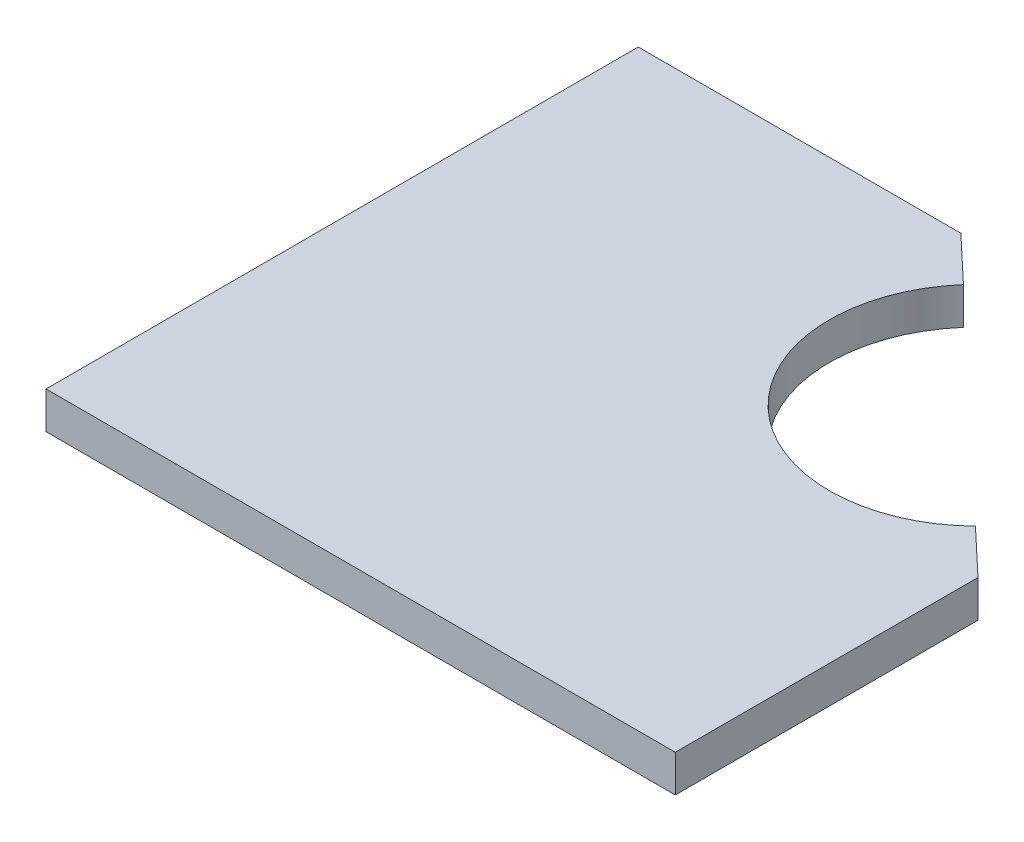
ISO-10303-21;
HEADER;
FILE_DESCRIPTION(('STEP AP214'),'2;1');
FILE_NAME('part.step','',(''),(''),'','','');
FILE_SCHEMA(('AUTOMOTIVE_DESIGN { 1 0 10303 214 1 1 1 1 }'));
ENDSEC;
DATA;
#1=APPLICATION_CONTEXT('core data for automotive mechanical design processes');
#2=APPLICATION_PROTOCOL_DEFINITION('international standard','automotive_design',2000,#1);
#3=PRODUCT_CONTEXT('',#1,'mechanical');
#4=PRODUCT('Part','Part','',(#3));
#5=PRODUCT_RELATED_PRODUCT_CATEGORY('part','',(#4));
#6=PRODUCT_DEFINITION_FORMATION('','',#4);
#7=PRODUCT_DEFINITION_CONTEXT('part definition',#1,'design');
#8=PRODUCT_DEFINITION('design','',#6,#7);
#9=PRODUCT_DEFINITION_SHAPE('','',#8);
#10=(LENGTH_UNIT() NAMED_UNIT(*) SI_UNIT(.MILLI.,.METRE.));
#11=(NAMED_UNIT(*) PLANE_ANGLE_UNIT() SI_UNIT($,.RADIAN.));
#12=(NAMED_UNIT(*) SI_UNIT($,.STERADIAN.) SOLID_ANGLE_UNIT());
#13=UNCERTAINTY_MEASURE_WITH_UNIT(LENGTH_MEASURE(1.E-05),#10,'distance_accuracy_value','');
#14=(GEOMETRIC_REPRESENTATION_CONTEXT(3) GLOBAL_UNCERTAINTY_ASSIGNED_CONTEXT((#13)) GLOBAL_UNIT_ASSIGNED_CONTEXT((#10,
#11,#12)) REPRESENTATION_CONTEXT('',''));
#15=CARTESIAN_POINT('',(0.,0.,0.));
#16=DIRECTION('',(0.,0.,1.));
#17=DIRECTION('',(1.,0.,0.));
#18=AXIS2_PLACEMENT_3D('',#15,#16,#17);
#19=CARTESIAN_POINT('',(22.3125,5.,-21.));
#20=DIRECTION('',(0.,-1.,0.));
#21=DIRECTION('',(0.,0.,-1.));
#22=AXIS2_PLACEMENT_3D('',#19,#20,#21);
#23=CYLINDRICAL_SURFACE('',#22,20.);
#24=CARTESIAN_POINT('',(22.3125,0.,-21.));
#25=DIRECTION('',(0.,1.,0.));
#26=DIRECTION('',(0.,0.,1.));
#27=AXIS2_PLACEMENT_3D('',#24,#25,#26);
#28=CIRCLE('',#27,20.);
#29=CARTESIAN_POINT('',(7.25617496759492,0.,-34.1646145601978));
#30=VERTEX_POINT('',#29);
#31=CARTESIAN_POINT('',(36.3195245515459,0.,-6.72403196934119));
#32=VERTEX_POINT('',#31);
#33=EDGE_CURVE('E122',#30,#32,#28,.T.);
#34=ORIENTED_EDGE('',*,*,#33,.F.);
#35=DIRECTION('',(0.,-1.,0.));
#36=VECTOR('',#35,1.);
#37=CARTESIAN_POINT('',(7.25617496759492,5.,-34.1646145601978));
#38=LINE('',#37,#36);
#39=CARTESIAN_POINT('',(7.25617496759492,5.,-34.1646145601978));
#40=VERTEX_POINT('',#39);
#41=EDGE_CURVE('E11',#40,#30,#38,.T.);
#42=ORIENTED_EDGE('',*,*,#41,.F.);
#43=CARTESIAN_POINT('',(22.3125,5.,-21.));
#44=DIRECTION('',(0.,1.,0.));
#45=DIRECTION('',(0.,0.,1.));
#46=AXIS2_PLACEMENT_3D('',#43,#44,#45);
#47=CIRCLE('',#46,20.);
#48=CARTESIAN_POINT('',(36.3195245515459,5.,-6.72403196934119));
#49=VERTEX_POINT('',#48);
#50=EDGE_CURVE('E139',#40,#49,#47,.T.);
#51=ORIENTED_EDGE('',*,*,#50,.T.);
#52=DIRECTION('',(0.,-1.,0.));
#53=VECTOR('',#52,1.);
#54=CARTESIAN_POINT('',(36.3195245515459,5.,-6.72403196934119));
#55=LINE('',#54,#53);
#56=EDGE_CURVE('E51',#49,#32,#55,.T.);
#57=ORIENTED_EDGE('',*,*,#56,.T.);
#58=EDGE_LOOP('',(#34,#42,#51,#57));
#59=FACE_BOUND('',#58,.T.);
#60=ADVANCED_FACE('F35',(#59),#23,.F.);
#61=CARTESIAN_POINT('',(20.4740163325139,5.,-21.6847981302571));
#62=DIRECTION('',(0.686515934094375,0.,-0.727114758641665));
#63=DIRECTION('',(-0.727114758641665,0.,-0.686515934094375));
#64=AXIS2_PLACEMENT_3D('',#61,#62,#63);
#65=PLANE('',#64);
#66=DIRECTION('',(0.727114758641665,0.,0.686515934094375));
#67=VECTOR('',#66,1.);
#68=CARTESIAN_POINT('',(20.4740163325139,0.,-21.6847981302571));
#69=LINE('',#68,#67);
#70=CARTESIAN_POINT('',(1.07569951914076,0.,-40.));
#71=VERTEX_POINT('',#70);
#72=EDGE_CURVE('E124',#71,#30,#69,.T.);
#73=ORIENTED_EDGE('',*,*,#72,.F.);
#74=DIRECTION('',(0.,-1.,0.));
#75=VECTOR('',#74,1.);
#76=CARTESIAN_POINT('',(1.07569951914076,5.,-40.));
#77=LINE('',#76,#75);
#78=CARTESIAN_POINT('',(1.07569951914076,5.,-40.));
#79=VERTEX_POINT('',#78);
#80=EDGE_CURVE('E43',#79,#71,#77,.T.);
#81=ORIENTED_EDGE('',*,*,#80,.F.);
#82=DIRECTION('',(0.727114758641665,0.,0.686515934094375));
#83=VECTOR('',#82,1.);
#84=CARTESIAN_POINT('',(20.4740163325139,5.,-21.6847981302571));
#85=LINE('',#84,#83);
#86=EDGE_CURVE('E159',#79,#40,#85,.T.);
#87=ORIENTED_EDGE('',*,*,#86,.T.);
#88=ORIENTED_EDGE('',*,*,#41,.T.);
#89=EDGE_LOOP('',(#73,#81,#87,#88));
#90=FACE_BOUND('',#89,.T.);
#91=ADVANCED_FACE('F153',(#90),#65,.T.);
#92=CARTESIAN_POINT('',(0.,5.,-40.));
#93=DIRECTION('',(0.,0.,-1.));
#94=DIRECTION('',(-1.,0.,0.));
#95=AXIS2_PLACEMENT_3D('',#92,#93,#94);
#96=PLANE('',#95);
#97=DIRECTION('',(1.,0.,0.));
#98=VECTOR('',#97,1.);
#99=CARTESIAN_POINT('',(0.,0.,-40.));
#100=LINE('',#99,#98);
#101=CARTESIAN_POINT('',(-42.5,0.,-40.));
#102=VERTEX_POINT('',#101);
#103=EDGE_CURVE('E127',#102,#71,#100,.T.);
#104=ORIENTED_EDGE('',*,*,#103,.F.);
#105=DIRECTION('',(0.,-1.,0.));
#106=VECTOR('',#105,1.);
#107=CARTESIAN_POINT('',(-42.5,5.,-40.));
#108=LINE('',#107,#106);
#109=CARTESIAN_POINT('',(-42.5,5.,-40.));
#110=VERTEX_POINT('',#109);
#111=EDGE_CURVE('E143',#110,#102,#108,.T.);
#112=ORIENTED_EDGE('',*,*,#111,.F.);
#113=DIRECTION('',(1.,0.,0.));
#114=VECTOR('',#113,1.);
#115=CARTESIAN_POINT('',(0.,5.,-40.));
#116=LINE('',#115,#114);
#117=EDGE_CURVE('E149',#110,#79,#116,.T.);
#118=ORIENTED_EDGE('',*,*,#117,.T.);
#119=ORIENTED_EDGE('',*,*,#80,.T.);
#120=EDGE_LOOP('',(#104,#112,#118,#119));
#121=FACE_BOUND('',#120,.T.);
#122=ADVANCED_FACE('F148',(#121),#96,.T.);
#123=CARTESIAN_POINT('',(-42.5,5.,0.));
#124=DIRECTION('',(-1.,0.,0.));
#125=DIRECTION('',(0.,0.,1.));
#126=AXIS2_PLACEMENT_3D('',#123,#124,#125);
#127=PLANE('',#126);
#128=DIRECTION('',(0.,0.,-1.));
#129=VECTOR('',#128,1.);
#130=CARTESIAN_POINT('',(-42.5,0.,0.));
#131=LINE('',#130,#129);
#132=CARTESIAN_POINT('',(-42.5,0.,40.));
#133=VERTEX_POINT('',#132);
#134=EDGE_CURVE('E130',#133,#102,#131,.T.);
#135=ORIENTED_EDGE('',*,*,#134,.F.);
#136=DIRECTION('',(0.,-1.,0.));
#137=VECTOR('',#136,1.);
#138=CARTESIAN_POINT('',(-42.5,5.,40.));
#139=LINE('',#138,#137);
#140=CARTESIAN_POINT('',(-42.5,5.,40.));
#141=VERTEX_POINT('',#140);
#142=EDGE_CURVE('E104',#141,#133,#139,.T.);
#143=ORIENTED_EDGE('',*,*,#142,.F.);
#144=DIRECTION('',(0.,0.,-1.));
#145=VECTOR('',#144,1.);
#146=CARTESIAN_POINT('',(-42.5,5.,0.));
#147=LINE('',#146,#145);
#148=EDGE_CURVE('E114',#141,#110,#147,.T.);
#149=ORIENTED_EDGE('',*,*,#148,.T.);
#150=ORIENTED_EDGE('',*,*,#111,.T.);
#151=EDGE_LOOP('',(#135,#143,#149,#150));
#152=FACE_BOUND('',#151,.T.);
#153=ADVANCED_FACE('F158',(#152),#127,.T.);
#154=CARTESIAN_POINT('',(0.,5.,40.));
#155=DIRECTION('',(0.,0.,1.));
#156=DIRECTION('',(1.,0.,0.));
#157=AXIS2_PLACEMENT_3D('',#154,#155,#156);
#158=PLANE('',#157);
#159=DIRECTION('',(-1.,0.,0.));
#160=VECTOR('',#159,1.);
#161=CARTESIAN_POINT('',(0.,0.,40.));
#162=LINE('',#161,#160);
#163=CARTESIAN_POINT('',(42.5,0.,40.));
#164=VERTEX_POINT('',#163);
#165=EDGE_CURVE('E100',#164,#133,#162,.T.);
#166=ORIENTED_EDGE('',*,*,#165,.F.);
#167=DIRECTION('',(0.,-1.,0.));
#168=VECTOR('',#167,1.);
#169=CARTESIAN_POINT('',(42.5,5.,40.));
#170=LINE('',#169,#168);
#171=CARTESIAN_POINT('',(42.5,5.,40.));
#172=VERTEX_POINT('',#171);
#173=EDGE_CURVE('E95',#172,#164,#170,.T.);
#174=ORIENTED_EDGE('',*,*,#173,.F.);
#175=DIRECTION('',(-1.,0.,0.));
#176=VECTOR('',#175,1.);
#177=CARTESIAN_POINT('',(0.,5.,40.));
#178=LINE('',#177,#176);
#179=EDGE_CURVE('E98',#172,#141,#178,.T.);
#180=ORIENTED_EDGE('',*,*,#179,.T.);
#181=ORIENTED_EDGE('',*,*,#142,.T.);
#182=EDGE_LOOP('',(#166,#174,#180,#181));
#183=FACE_BOUND('',#182,.T.);
#184=ADVANCED_FACE('F97',(#183),#158,.T.);
#185=CARTESIAN_POINT('',(42.5,5.,0.));
#186=DIRECTION('',(1.,0.,0.));
#187=DIRECTION('',(0.,0.,-1.));
#188=AXIS2_PLACEMENT_3D('',#185,#186,#187);
#189=PLANE('',#188);
#190=DIRECTION('',(0.,0.,1.));
#191=VECTOR('',#190,1.);
#192=CARTESIAN_POINT('',(42.5,0.,0.));
#193=LINE('',#192,#191);
#194=CARTESIAN_POINT('',(42.5,0.,-0.888646529538992));
#195=VERTEX_POINT('',#194);
#196=EDGE_CURVE('E134',#195,#164,#193,.T.);
#197=ORIENTED_EDGE('',*,*,#196,.F.);
#198=DIRECTION('',(0.,-1.,0.));
#199=VECTOR('',#198,1.);
#200=CARTESIAN_POINT('',(42.5,5.,-0.888646529538992));
#201=LINE('',#200,#199);
#202=CARTESIAN_POINT('',(42.5,5.,-0.888646529538992));
#203=VERTEX_POINT('',#202);
#204=EDGE_CURVE('E73',#203,#195,#201,.T.);
#205=ORIENTED_EDGE('',*,*,#204,.F.);
#206=DIRECTION('',(0.,0.,1.));
#207=VECTOR('',#206,1.);
#208=CARTESIAN_POINT('',(42.5,5.,0.));
#209=LINE('',#208,#207);
#210=EDGE_CURVE('E111',#203,#172,#209,.T.);
#211=ORIENTED_EDGE('',*,*,#210,.T.);
#212=ORIENTED_EDGE('',*,*,#173,.T.);
#213=EDGE_LOOP('',(#197,#205,#211,#212));
#214=FACE_BOUND('',#213,.T.);
#215=ADVANCED_FACE('F116',(#214),#189,.T.);
#216=CARTESIAN_POINT('',(20.474016332514,5.,-21.6847981302571));
#217=DIRECTION('',(0.686515934094375,0.,-0.727114758641665));
#218=DIRECTION('',(-0.727114758641665,0.,-0.686515934094375));
#219=AXIS2_PLACEMENT_3D('',#216,#217,#218);
#220=PLANE('',#219);
#221=DIRECTION('',(0.727114758641665,0.,0.686515934094375));
#222=VECTOR('',#221,1.);
#223=CARTESIAN_POINT('',(20.474016332514,0.,-21.6847981302571));
#224=LINE('',#223,#222);
#225=EDGE_CURVE('E136',#32,#195,#224,.T.);
#226=ORIENTED_EDGE('',*,*,#225,.F.);
#227=ORIENTED_EDGE('',*,*,#56,.F.);
#228=DIRECTION('',(0.727114758641665,0.,0.686515934094375));
#229=VECTOR('',#228,1.);
#230=CARTESIAN_POINT('',(20.474016332514,5.,-21.6847981302571));
#231=LINE('',#230,#229);
#232=EDGE_CURVE('E117',#49,#203,#231,.T.);
#233=ORIENTED_EDGE('',*,*,#232,.T.);
#234=ORIENTED_EDGE('',*,*,#204,.T.);
#235=EDGE_LOOP('',(#226,#227,#233,#234));
#236=FACE_BOUND('',#235,.T.);
#237=ADVANCED_FACE('F163',(#236),#220,.T.);
#238=CARTESIAN_POINT('',(0.,5.,0.));
#239=DIRECTION('',(0.,1.,0.));
#240=DIRECTION('',(0.,0.,1.));
#241=AXIS2_PLACEMENT_3D('',#238,#239,#240);
#242=PLANE('',#241);
#243=ORIENTED_EDGE('',*,*,#50,.F.);
#244=ORIENTED_EDGE('',*,*,#86,.F.);
#245=ORIENTED_EDGE('',*,*,#117,.F.);
#246=ORIENTED_EDGE('',*,*,#148,.F.);
#247=ORIENTED_EDGE('',*,*,#179,.F.);
#248=ORIENTED_EDGE('',*,*,#210,.F.);
#249=ORIENTED_EDGE('',*,*,#232,.F.);
#250=EDGE_LOOP('',(#243,#244,#245,#246,#247,#248,#249));
#251=FACE_BOUND('',#250,.T.);
#252=ADVANCED_FACE('F109',(#251),#242,.T.);
#253=CARTESIAN_POINT('',(0.,0.,0.));
#254=DIRECTION('',(0.,1.,0.));
#255=DIRECTION('',(0.,0.,1.));
#256=AXIS2_PLACEMENT_3D('',#253,#254,#255);
#257=PLANE('',#256);
#258=ORIENTED_EDGE('',*,*,#33,.T.);
#259=ORIENTED_EDGE('',*,*,#225,.T.);
#260=ORIENTED_EDGE('',*,*,#196,.T.);
#261=ORIENTED_EDGE('',*,*,#165,.T.);
#262=ORIENTED_EDGE('',*,*,#134,.T.);
#263=ORIENTED_EDGE('',*,*,#103,.T.);
#264=ORIENTED_EDGE('',*,*,#72,.T.);
#265=EDGE_LOOP('',(#258,#259,#260,#261,#262,#263,#264));
#266=FACE_BOUND('',#265,.T.);
#267=ADVANCED_FACE('F155',(#266),#257,.F.);
#268=CLOSED_SHELL('',(#60,#91,#122,#153,#184,#215,#237,#252,#267));
#269=MANIFOLD_SOLID_BREP('B2',#268);
#270=ADVANCED_BREP_SHAPE_REPRESENTATION('',(#18,#269),#14);
#271=SHAPE_DEFINITION_REPRESENTATION(#9,#270);
ENDSEC;
END-ISO-10303-21;
